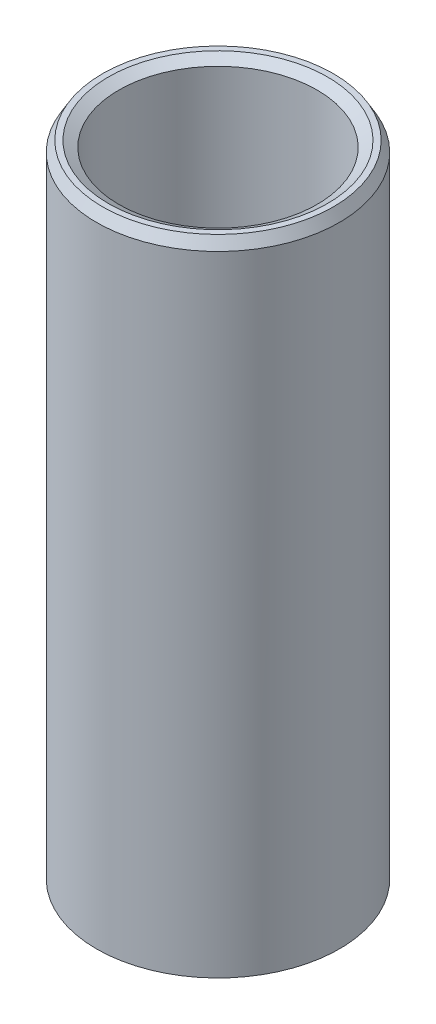
ISO-10303-21;
HEADER;
FILE_DESCRIPTION(('STEP AP214'),'2;1');
FILE_NAME('part.step','',(''),(''),'','','');
FILE_SCHEMA(('AUTOMOTIVE_DESIGN { 1 0 10303 214 1 1 1 1 }'));
ENDSEC;
DATA;
#1=APPLICATION_CONTEXT('core data for automotive mechanical design processes');
#2=APPLICATION_PROTOCOL_DEFINITION('international standard','automotive_design',2000,#1);
#3=PRODUCT_CONTEXT('',#1,'mechanical');
#4=PRODUCT('Part','Part','',(#3));
#5=PRODUCT_RELATED_PRODUCT_CATEGORY('part','',(#4));
#6=PRODUCT_DEFINITION_FORMATION('','',#4);
#7=PRODUCT_DEFINITION_CONTEXT('part definition',#1,'design');
#8=PRODUCT_DEFINITION('design','',#6,#7);
#9=PRODUCT_DEFINITION_SHAPE('','',#8);
#10=(LENGTH_UNIT() NAMED_UNIT(*) SI_UNIT(.MILLI.,.METRE.));
#11=(NAMED_UNIT(*) PLANE_ANGLE_UNIT() SI_UNIT($,.RADIAN.));
#12=(NAMED_UNIT(*) SI_UNIT($,.STERADIAN.) SOLID_ANGLE_UNIT());
#13=UNCERTAINTY_MEASURE_WITH_UNIT(LENGTH_MEASURE(1.E-05),#10,'distance_accuracy_value','');
#14=(GEOMETRIC_REPRESENTATION_CONTEXT(3) GLOBAL_UNCERTAINTY_ASSIGNED_CONTEXT((#13)) GLOBAL_UNIT_ASSIGNED_CONTEXT((#10,
#11,#12)) REPRESENTATION_CONTEXT('',''));
#15=CARTESIAN_POINT('',(0.,0.,0.));
#16=DIRECTION('',(0.,0.,1.));
#17=DIRECTION('',(1.,0.,0.));
#18=AXIS2_PLACEMENT_3D('',#15,#16,#17);
#19=CARTESIAN_POINT('',(0.,239.223480908937,0.));
#20=DIRECTION('',(0.,-1.,0.));
#21=DIRECTION('',(0.,0.,-1.));
#22=AXIS2_PLACEMENT_3D('',#19,#20,#21);
#23=CYLINDRICAL_SURFACE('',#22,45.);
#24=CARTESIAN_POINT('',(0.,2.24210142254197,0.));
#25=DIRECTION('',(0.,1.,0.));
#26=DIRECTION('',(0.,0.,1.));
#27=AXIS2_PLACEMENT_3D('',#24,#25,#26);
#28=CIRCLE('',#27,45.);
#29=CARTESIAN_POINT('',(0.,2.24210142254197,-45.));
#30=VERTEX_POINT('',#29);
#31=EDGE_CURVE('E10',#30,#30,#28,.T.);
#32=CARTESIAN_POINT('',(0.,235.340047329372,0.));
#33=DIRECTION('',(0.,1.,0.));
#34=DIRECTION('',(0.,0.,1.));
#35=AXIS2_PLACEMENT_3D('',#32,#33,#34);
#36=CIRCLE('',#35,45.);
#37=CARTESIAN_POINT('',(0.,235.340047329372,-45.));
#38=VERTEX_POINT('',#37);
#39=EDGE_CURVE('E50',#38,#38,#36,.F.);
#40=CARTESIAN_POINT('',(0.,2.24210142254197,-45.));
#41=CARTESIAN_POINT('',(0.,4.67020502573811,-45.));
#42=CARTESIAN_POINT('',(0.,7.09830862893426,-45.));
#43=CARTESIAN_POINT('',(0.,11.9545158353265,-45.));
#44=CARTESIAN_POINT('',(0.,14.3826194385227,-45.));
#45=CARTESIAN_POINT('',(0.,19.238826644915,-45.));
#46=CARTESIAN_POINT('',(0.,21.6669302481111,-45.));
#47=CARTESIAN_POINT('',(0.,26.5231374545034,-45.));
#48=CARTESIAN_POINT('',(0.,28.9512410576995,-45.));
#49=CARTESIAN_POINT('',(0.,33.8074482640918,-45.));
#50=CARTESIAN_POINT('',(0.,36.235551867288,-45.));
#51=CARTESIAN_POINT('',(0.,41.0917590736803,-45.));
#52=CARTESIAN_POINT('',(0.,43.5198626768764,-45.));
#53=CARTESIAN_POINT('',(0.,48.3760698832687,-45.));
#54=CARTESIAN_POINT('',(0.,50.8041734864648,-45.));
#55=CARTESIAN_POINT('',(0.,55.6603806928571,-45.));
#56=CARTESIAN_POINT('',(0.,58.0884842960533,-45.));
#57=CARTESIAN_POINT('',(0.,62.9446915024456,-45.));
#58=CARTESIAN_POINT('',(0.,65.3727951056417,-45.));
#59=CARTESIAN_POINT('',(0.,70.229002312034,-45.));
#60=CARTESIAN_POINT('',(0.,72.6571059152301,-45.));
#61=CARTESIAN_POINT('',(0.,77.5133131216224,-45.));
#62=CARTESIAN_POINT('',(0.,79.9414167248186,-45.));
#63=CARTESIAN_POINT('',(0.,84.7976239312109,-45.));
#64=CARTESIAN_POINT('',(0.,87.225727534407,-45.));
#65=CARTESIAN_POINT('',(0.,92.0819347407993,-45.));
#66=CARTESIAN_POINT('',(0.,94.5100383439954,-45.));
#67=CARTESIAN_POINT('',(0.,99.3662455503877,-45.));
#68=CARTESIAN_POINT('',(0.,101.794349153584,-45.));
#69=CARTESIAN_POINT('',(0.,106.650556359976,-45.));
#70=CARTESIAN_POINT('',(0.,109.078659963172,-45.));
#71=CARTESIAN_POINT('',(0.,113.934867169565,-45.));
#72=CARTESIAN_POINT('',(0.,116.362970772761,-45.));
#73=CARTESIAN_POINT('',(0.,121.219177979153,-45.));
#74=CARTESIAN_POINT('',(0.,123.647281582349,-45.));
#75=CARTESIAN_POINT('',(0.,128.503488788741,-45.));
#76=CARTESIAN_POINT('',(0.,130.931592391938,-45.));
#77=CARTESIAN_POINT('',(0.,135.78779959833,-45.));
#78=CARTESIAN_POINT('',(0.,138.215903201526,-45.));
#79=CARTESIAN_POINT('',(0.,143.072110407918,-45.));
#80=CARTESIAN_POINT('',(0.,145.500214011114,-45.));
#81=CARTESIAN_POINT('',(0.,150.356421217507,-45.));
#82=CARTESIAN_POINT('',(0.,152.784524820703,-45.));
#83=CARTESIAN_POINT('',(0.,157.640732027095,-45.));
#84=CARTESIAN_POINT('',(0.,160.068835630291,-45.));
#85=CARTESIAN_POINT('',(0.,164.925042836684,-45.));
#86=CARTESIAN_POINT('',(0.,167.35314643988,-45.));
#87=CARTESIAN_POINT('',(0.,172.209353646272,-45.));
#88=CARTESIAN_POINT('',(0.,174.637457249468,-45.));
#89=CARTESIAN_POINT('',(0.,179.49366445586,-45.));
#90=CARTESIAN_POINT('',(0.,181.921768059057,-45.));
#91=CARTESIAN_POINT('',(0.,186.777975265449,-45.));
#92=CARTESIAN_POINT('',(0.,189.206078868645,-45.));
#93=CARTESIAN_POINT('',(0.,194.062286075037,-45.));
#94=CARTESIAN_POINT('',(0.,196.490389678233,-45.));
#95=CARTESIAN_POINT('',(0.,201.346596884626,-45.));
#96=CARTESIAN_POINT('',(0.,203.774700487822,-45.));
#97=CARTESIAN_POINT('',(0.,208.630907694214,-45.));
#98=CARTESIAN_POINT('',(0.,211.05901129741,-45.));
#99=CARTESIAN_POINT('',(0.,215.915218503803,-45.));
#100=CARTESIAN_POINT('',(0.,218.343322106999,-45.));
#101=CARTESIAN_POINT('',(0.,223.199529313391,-45.));
#102=CARTESIAN_POINT('',(0.,225.627632916587,-45.));
#103=CARTESIAN_POINT('',(0.,230.483840122979,-45.));
#104=CARTESIAN_POINT('',(0.,232.911943726176,-45.));
#105=CARTESIAN_POINT('',(0.,235.340047329372,-45.));
#106=B_SPLINE_CURVE_WITH_KNOTS('',3,(#40,#41,#42,#43,#44,#45,#46,#47,#48,#49,#50,#51,#52,#53,
#54,#55,#56,#57,#58,#59,#60,#61,#62,#63,#64,#65,#66,#67,#68,#69,#70,#71,#72,#73,#74,#75,#76,#77,
#78,#79,#80,#81,#82,#83,#84,#85,#86,#87,#88,#89,#90,#91,#92,#93,#94,#95,#96,#97,#98,#99,#100,
#101,#102,#103,#104,#105),.UNSPECIFIED.,.F.,.F.,(4,2,2,2,2,2,2,2,2,2,2,2,2,2,2,2,2,2,2,2,2,2,2,
2,2,2,2,2,2,2,2,2,4),(0.,7.28431080958844,14.5686216191769,21.8529324287653,29.1372432383537,
36.4215540479421,43.7058648575306,50.990175667119,58.2744864767074,65.5587972862959,
72.8431080958843,80.1274189054727,87.4117297150612,94.6960405246496,101.980351334238,
109.264662143826,116.548972953415,123.833283763003,131.117594572592,138.40190538218,
145.686216191769,152.970527001357,160.254837810945,167.539148620534,174.823459430122,
182.107770239711,189.392081049299,196.676391858888,203.960702668476,211.245013478064,
218.529324287653,225.813635097241,233.09794590683),.UNSPECIFIED.);
#107=EDGE_CURVE('BSEAM39',#30,#38,#106,.T.);
#108=ORIENTED_EDGE('',*,*,#31,.T.);
#109=ORIENTED_EDGE('',*,*,#39,.T.);
#110=ORIENTED_EDGE('',*,*,#107,.T.);
#111=ORIENTED_EDGE('',*,*,#107,.F.);
#112=EDGE_LOOP('',(#108,#110,#109,#111));
#113=FACE_BOUND('',#112,.T.);
#114=ADVANCED_FACE('F39',(#113),#23,.T.);
#115=CARTESIAN_POINT('',(0.,239.223480908937,0.));
#116=DIRECTION('',(0.,1.,0.));
#117=DIRECTION('',(0.,0.,1.));
#118=AXIS2_PLACEMENT_3D('',#115,#116,#117);
#119=PLANE('',#118);
#120=CARTESIAN_POINT('',(0.,239.223480908937,0.));
#121=DIRECTION('',(0.,1.,0.));
#122=DIRECTION('',(0.,0.,1.));
#123=AXIS2_PLACEMENT_3D('',#120,#121,#122);
#124=CIRCLE('',#123,40.6160787228583);
#125=CARTESIAN_POINT('',(0.,239.223480908937,40.6160787228583));
#126=VERTEX_POINT('',#125);
#127=EDGE_CURVE('E58',#126,#126,#124,.F.);
#128=ORIENTED_EDGE('',*,*,#127,.T.);
#129=EDGE_LOOP('',(#128));
#130=FACE_BOUND('',#129,.T.);
#131=CARTESIAN_POINT('',(0.,239.223480908937,0.));
#132=DIRECTION('',(0.,1.,0.));
#133=DIRECTION('',(0.,0.,1.));
#134=AXIS2_PLACEMENT_3D('',#131,#132,#133);
#135=CIRCLE('',#134,42.7578985774581);
#136=CARTESIAN_POINT('',(0.,239.223480908937,42.7578985774581));
#137=VERTEX_POINT('',#136);
#138=EDGE_CURVE('E61',#137,#137,#135,.T.);
#139=ORIENTED_EDGE('',*,*,#138,.T.);
#140=EDGE_LOOP('',(#139));
#141=FACE_BOUND('',#140,.T.);
#142=ADVANCED_FACE('F88',(#130,#141),#119,.T.);
#143=CARTESIAN_POINT('',(0.,0.,0.));
#144=DIRECTION('',(0.,1.,0.));
#145=DIRECTION('',(0.,0.,1.));
#146=AXIS2_PLACEMENT_3D('',#143,#144,#145);
#147=PLANE('',#146);
#148=CARTESIAN_POINT('',(0.,0.,0.));
#149=DIRECTION('',(0.,1.,0.));
#150=DIRECTION('',(0.,0.,1.));
#151=AXIS2_PLACEMENT_3D('',#148,#149,#150);
#152=CIRCLE('',#151,38.9747465658351);
#153=CARTESIAN_POINT('',(0.,0.,38.9747465658351));
#154=VERTEX_POINT('',#153);
#155=EDGE_CURVE('E51',#154,#154,#152,.T.);
#156=ORIENTED_EDGE('',*,*,#155,.T.);
#157=EDGE_LOOP('',(#156));
#158=FACE_BOUND('',#157,.T.);
#159=CARTESIAN_POINT('',(0.,0.,0.));
#160=DIRECTION('',(0.,1.,0.));
#161=DIRECTION('',(0.,0.,1.));
#162=AXIS2_PLACEMENT_3D('',#159,#160,#161);
#163=CIRCLE('',#162,41.1165664204348);
#164=CARTESIAN_POINT('',(0.,0.,41.1165664204348));
#165=VERTEX_POINT('',#164);
#166=EDGE_CURVE('E54',#165,#165,#163,.F.);
#167=ORIENTED_EDGE('',*,*,#166,.T.);
#168=EDGE_LOOP('',(#167));
#169=FACE_BOUND('',#168,.T.);
#170=ADVANCED_FACE('F83',(#158,#169),#147,.F.);
#171=CARTESIAN_POINT('',(0.,239.223480908937,0.));
#172=DIRECTION('',(0.,-1.,0.));
#173=DIRECTION('',(0.,0.,-1.));
#174=AXIS2_PLACEMENT_3D('',#171,#172,#173);
#175=CYLINDRICAL_SURFACE('',#174,36.7326451432932);
#176=CARTESIAN_POINT('',(0.,236.981379486395,0.));
#177=DIRECTION('',(0.,1.,0.));
#178=DIRECTION('',(0.,0.,1.));
#179=AXIS2_PLACEMENT_3D('',#176,#177,#178);
#180=CIRCLE('',#179,36.7326451432932);
#181=CARTESIAN_POINT('',(0.,236.981379486395,-36.7326451432932));
#182=VERTEX_POINT('',#181);
#183=EDGE_CURVE('E67',#182,#182,#180,.T.);
#184=CARTESIAN_POINT('',(0.,3.88343357956503,0.));
#185=DIRECTION('',(0.,1.,0.));
#186=DIRECTION('',(0.,0.,1.));
#187=AXIS2_PLACEMENT_3D('',#184,#185,#186);
#188=CIRCLE('',#187,36.7326451432932);
#189=CARTESIAN_POINT('',(0.,3.88343357956503,-36.7326451432932));
#190=VERTEX_POINT('',#189);
#191=EDGE_CURVE('E69',#190,#190,#188,.F.);
#192=CARTESIAN_POINT('',(0.,236.981379486395,-36.7326451432932));
#193=CARTESIAN_POINT('',(0.,234.553275883199,-36.7326451432932));
#194=CARTESIAN_POINT('',(0.,232.125172280003,-36.7326451432932));
#195=CARTESIAN_POINT('',(0.,227.26896507361,-36.7326451432932));
#196=CARTESIAN_POINT('',(0.,224.840861470414,-36.7326451432932));
#197=CARTESIAN_POINT('',(0.,219.984654264022,-36.7326451432932));
#198=CARTESIAN_POINT('',(0.,217.556550660826,-36.7326451432932));
#199=CARTESIAN_POINT('',(0.,212.700343454433,-36.7326451432932));
#200=CARTESIAN_POINT('',(0.,210.272239851237,-36.7326451432932));
#201=CARTESIAN_POINT('',(0.,205.416032644845,-36.7326451432932));
#202=CARTESIAN_POINT('',(0.,202.987929041649,-36.7326451432932));
#203=CARTESIAN_POINT('',(0.,198.131721835256,-36.7326451432932));
#204=CARTESIAN_POINT('',(0.,195.70361823206,-36.7326451432932));
#205=CARTESIAN_POINT('',(0.,190.847411025668,-36.7326451432932));
#206=CARTESIAN_POINT('',(0.,188.419307422472,-36.7326451432932));
#207=CARTESIAN_POINT('',(0.,183.56310021608,-36.7326451432932));
#208=CARTESIAN_POINT('',(0.,181.134996612883,-36.7326451432932));
#209=CARTESIAN_POINT('',(0.,176.278789406491,-36.7326451432932));
#210=CARTESIAN_POINT('',(0.,173.850685803295,-36.7326451432932));
#211=CARTESIAN_POINT('',(0.,168.994478596903,-36.7326451432932));
#212=CARTESIAN_POINT('',(0.,166.566374993707,-36.7326451432932));
#213=CARTESIAN_POINT('',(0.,161.710167787314,-36.7326451432932));
#214=CARTESIAN_POINT('',(0.,159.282064184118,-36.7326451432932));
#215=CARTESIAN_POINT('',(0.,154.425856977726,-36.7326451432932));
#216=CARTESIAN_POINT('',(0.,151.99775337453,-36.7326451432932));
#217=CARTESIAN_POINT('',(0.,147.141546168137,-36.7326451432932));
#218=CARTESIAN_POINT('',(0.,144.713442564941,-36.7326451432932));
#219=CARTESIAN_POINT('',(0.,139.857235358549,-36.7326451432932));
#220=CARTESIAN_POINT('',(0.,137.429131755353,-36.7326451432932));
#221=CARTESIAN_POINT('',(0.,132.572924548961,-36.7326451432932));
#222=CARTESIAN_POINT('',(0.,130.144820945764,-36.7326451432932));
#223=CARTESIAN_POINT('',(0.,125.288613739372,-36.7326451432932));
#224=CARTESIAN_POINT('',(0.,122.860510136176,-36.7326451432932));
#225=CARTESIAN_POINT('',(0.,118.004302929784,-36.7326451432932));
#226=CARTESIAN_POINT('',(0.,115.576199326588,-36.7326451432932));
#227=CARTESIAN_POINT('',(0.,110.719992120195,-36.7326451432932));
#228=CARTESIAN_POINT('',(0.,108.291888516999,-36.7326451432932));
#229=CARTESIAN_POINT('',(0.,103.435681310607,-36.7326451432932));
#230=CARTESIAN_POINT('',(0.,101.007577707411,-36.7326451432932));
#231=CARTESIAN_POINT('',(0.,96.1513705010185,-36.7326451432932));
#232=CARTESIAN_POINT('',(0.,93.7232668978223,-36.7326451432932));
#233=CARTESIAN_POINT('',(0.,88.8670596914301,-36.7326451432932));
#234=CARTESIAN_POINT('',(0.,86.4389560882339,-36.7326451432932));
#235=CARTESIAN_POINT('',(0.,81.5827488818416,-36.7326451432932));
#236=CARTESIAN_POINT('',(0.,79.1546452786455,-36.7326451432932));
#237=CARTESIAN_POINT('',(0.,74.2984380722532,-36.7326451432932));
#238=CARTESIAN_POINT('',(0.,71.8703344690571,-36.7326451432932));
#239=CARTESIAN_POINT('',(0.,67.0141272626648,-36.7326451432932));
#240=CARTESIAN_POINT('',(0.,64.5860236594686,-36.7326451432932));
#241=CARTESIAN_POINT('',(0.,59.7298164530763,-36.7326451432932));
#242=CARTESIAN_POINT('',(0.,57.3017128498802,-36.7326451432932));
#243=CARTESIAN_POINT('',(0.,52.4455056434879,-36.7326451432932));
#244=CARTESIAN_POINT('',(0.,50.0174020402918,-36.7326451432932));
#245=CARTESIAN_POINT('',(0.,45.1611948338995,-36.7326451432932));
#246=CARTESIAN_POINT('',(0.,42.7330912307033,-36.7326451432932));
#247=CARTESIAN_POINT('',(0.,37.876884024311,-36.7326451432932));
#248=CARTESIAN_POINT('',(0.,35.4487804211149,-36.7326451432932));
#249=CARTESIAN_POINT('',(0.,30.5925732147226,-36.7326451432932));
#250=CARTESIAN_POINT('',(0.,28.1644696115265,-36.7326451432932));
#251=CARTESIAN_POINT('',(0.,23.3082624051342,-36.7326451432932));
#252=CARTESIAN_POINT('',(0.,20.880158801938,-36.7326451432932));
#253=CARTESIAN_POINT('',(0.,16.0239515955457,-36.7326451432932));
#254=CARTESIAN_POINT('',(0.,13.5958479923496,-36.7326451432932));
#255=CARTESIAN_POINT('',(0.,8.73964078595732,-36.7326451432932));
#256=CARTESIAN_POINT('',(0.,6.31153718276117,-36.7326451432932));
#257=CARTESIAN_POINT('',(0.,3.88343357956503,-36.7326451432932));
#258=B_SPLINE_CURVE_WITH_KNOTS('',3,(#192,#193,#194,#195,#196,#197,#198,#199,#200,#201,#202,
#203,#204,#205,#206,#207,#208,#209,#210,#211,#212,#213,#214,#215,#216,#217,#218,#219,#220,#221,
#222,#223,#224,#225,#226,#227,#228,#229,#230,#231,#232,#233,#234,#235,#236,#237,#238,#239,#240,
#241,#242,#243,#244,#245,#246,#247,#248,#249,#250,#251,#252,#253,#254,#255,#256,#257),
.UNSPECIFIED.,.F.,.F.,(4,2,2,2,2,2,2,2,2,2,2,2,2,2,2,2,2,2,2,2,2,2,2,2,2,2,2,2,2,2,2,2,4),(0.,
7.28431080958841,14.5686216191769,21.8529324287653,29.1372432383537,36.4215540479421,
43.7058648575306,50.990175667119,58.2744864767074,65.5587972862959,72.8431080958843,
80.1274189054727,87.4117297150611,94.6960405246496,101.980351334238,109.264662143826,
116.548972953415,123.833283763003,131.117594572592,138.40190538218,145.686216191769,
152.970527001357,160.254837810945,167.539148620534,174.823459430122,182.107770239711,
189.392081049299,196.676391858888,203.960702668476,211.245013478064,218.529324287653,
225.813635097241,233.09794590683),.UNSPECIFIED.);
#259=EDGE_CURVE('BSEAM71',#182,#190,#258,.T.);
#260=ORIENTED_EDGE('',*,*,#183,.T.);
#261=ORIENTED_EDGE('',*,*,#191,.T.);
#262=ORIENTED_EDGE('',*,*,#259,.T.);
#263=ORIENTED_EDGE('',*,*,#259,.F.);
#264=EDGE_LOOP('',(#260,#262,#261,#263));
#265=FACE_BOUND('',#264,.T.);
#266=ADVANCED_FACE('F71',(#265),#175,.F.);
#267=CARTESIAN_POINT('',(0.,236.981379486395,0.));
#268=DIRECTION('',(0.,1.,0.));
#269=DIRECTION('',(0.,0.,1.));
#270=AXIS2_PLACEMENT_3D('',#267,#268,#269);
#271=CONICAL_SURFACE('',#270,36.7326451432932,1.04719755119659);
#272=ORIENTED_EDGE('',*,*,#127,.F.);
#273=EDGE_LOOP('',(#272));
#274=FACE_BOUND('',#273,.T.);
#275=ORIENTED_EDGE('',*,*,#183,.F.);
#276=EDGE_LOOP('',(#275));
#277=FACE_BOUND('',#276,.T.);
#278=ADVANCED_FACE('F77',(#274,#277),#271,.F.);
#279=CARTESIAN_POINT('',(0.,0.,0.));
#280=DIRECTION('',(0.,-1.,0.));
#281=DIRECTION('',(0.,0.,-1.));
#282=AXIS2_PLACEMENT_3D('',#279,#280,#281);
#283=CONICAL_SURFACE('',#282,38.9747465658351,0.523598775598294);
#284=ORIENTED_EDGE('',*,*,#191,.F.);
#285=EDGE_LOOP('',(#284));
#286=FACE_BOUND('',#285,.T.);
#287=ORIENTED_EDGE('',*,*,#155,.F.);
#288=EDGE_LOOP('',(#287));
#289=FACE_BOUND('',#288,.T.);
#290=ADVANCED_FACE('F73',(#286,#289),#283,.F.);
#291=CARTESIAN_POINT('',(0.,2.24210142254197,0.));
#292=DIRECTION('',(0.,1.,0.));
#293=DIRECTION('',(0.,0.,1.));
#294=AXIS2_PLACEMENT_3D('',#291,#292,#293);
#295=CONICAL_SURFACE('',#294,45.,1.0471975511966);
#296=ORIENTED_EDGE('',*,*,#166,.F.);
#297=EDGE_LOOP('',(#296));
#298=FACE_BOUND('',#297,.T.);
#299=ORIENTED_EDGE('',*,*,#31,.F.);
#300=EDGE_LOOP('',(#299));
#301=FACE_BOUND('',#300,.T.);
#302=ADVANCED_FACE('F76',(#298,#301),#295,.T.);
#303=CARTESIAN_POINT('',(0.,239.223480908937,0.));
#304=DIRECTION('',(0.,-1.,0.));
#305=DIRECTION('',(0.,0.,-1.));
#306=AXIS2_PLACEMENT_3D('',#303,#304,#305);
#307=CONICAL_SURFACE('',#306,42.7578985774581,0.523598775598296);
#308=ORIENTED_EDGE('',*,*,#39,.F.);
#309=EDGE_LOOP('',(#308));
#310=FACE_BOUND('',#309,.T.);
#311=ORIENTED_EDGE('',*,*,#138,.F.);
#312=EDGE_LOOP('',(#311));
#313=FACE_BOUND('',#312,.T.);
#314=ADVANCED_FACE('F45',(#310,#313),#307,.T.);
#315=CLOSED_SHELL('',(#114,#142,#170,#266,#278,#290,#302,#314));
#316=MANIFOLD_SOLID_BREP('B2',#315);
#317=ADVANCED_BREP_SHAPE_REPRESENTATION('',(#18,#316),#14);
#318=SHAPE_DEFINITION_REPRESENTATION(#9,#317);
ENDSEC;
END-ISO-10303-21;
